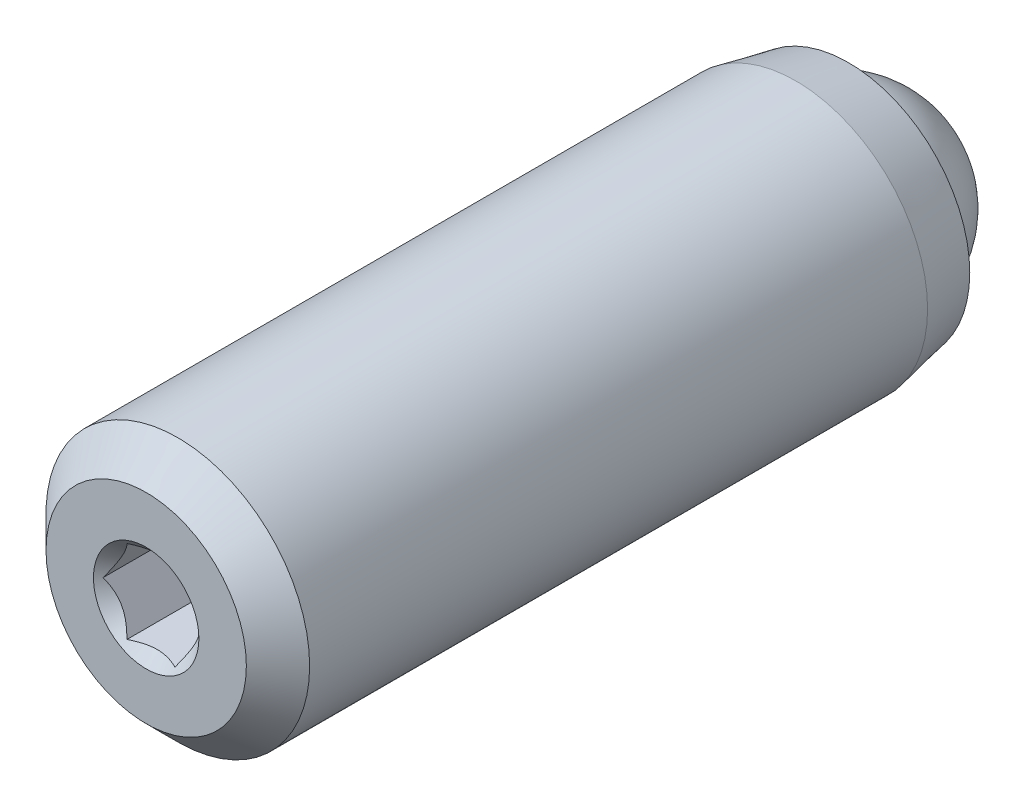
ISO-10303-21;
HEADER;
FILE_DESCRIPTION(('STEP AP214'),'2;1');
FILE_NAME('part.step','',(''),(''),'','','');
FILE_SCHEMA(('AUTOMOTIVE_DESIGN { 1 0 10303 214 1 1 1 1 }'));
ENDSEC;
DATA;
#1=APPLICATION_CONTEXT('core data for automotive mechanical design processes');
#2=APPLICATION_PROTOCOL_DEFINITION('international standard','automotive_design',2000,#1);
#3=PRODUCT_CONTEXT('',#1,'mechanical');
#4=PRODUCT('Part','Part','',(#3));
#5=PRODUCT_RELATED_PRODUCT_CATEGORY('part','',(#4));
#6=PRODUCT_DEFINITION_FORMATION('','',#4);
#7=PRODUCT_DEFINITION_CONTEXT('part definition',#1,'design');
#8=PRODUCT_DEFINITION('design','',#6,#7);
#9=PRODUCT_DEFINITION_SHAPE('','',#8);
#10=(LENGTH_UNIT() NAMED_UNIT(*) SI_UNIT(.MILLI.,.METRE.));
#11=(NAMED_UNIT(*) PLANE_ANGLE_UNIT() SI_UNIT($,.RADIAN.));
#12=(NAMED_UNIT(*) SI_UNIT($,.STERADIAN.) SOLID_ANGLE_UNIT());
#13=UNCERTAINTY_MEASURE_WITH_UNIT(LENGTH_MEASURE(1.E-05),#10,'distance_accuracy_value','');
#14=(GEOMETRIC_REPRESENTATION_CONTEXT(3) GLOBAL_UNCERTAINTY_ASSIGNED_CONTEXT((#13)) GLOBAL_UNIT_ASSIGNED_CONTEXT((#10,
#11,#12)) REPRESENTATION_CONTEXT('',''));
#15=CARTESIAN_POINT('',(0.,0.,0.));
#16=DIRECTION('',(0.,0.,1.));
#17=DIRECTION('',(1.,0.,0.));
#18=AXIS2_PLACEMENT_3D('',#15,#16,#17);
#19=CARTESIAN_POINT('',(9.74273900584421,-6.14099144723923,4.31418836824711));
#20=DIRECTION('',(0.,0.,-1.));
#21=DIRECTION('',(-1.,0.,0.));
#22=AXIS2_PLACEMENT_3D('',#19,#20,#21);
#23=PLANE('',#22);
#24=CARTESIAN_POINT('',(9.74273900584421,-6.14099144723923,4.31418836824711));
#25=DIRECTION('',(0.,0.,1.));
#26=DIRECTION('',(1.,0.,0.));
#27=AXIS2_PLACEMENT_3D('',#24,#25,#26);
#28=CIRCLE('',#27,1.27);
#29=CARTESIAN_POINT('',(11.0127390058442,-6.14099144723923,4.31418836824711));
#30=VERTEX_POINT('',#29);
#31=EDGE_CURVE('P0_E247',#30,#30,#28,.T.);
#32=ORIENTED_EDGE('',*,*,#31,.F.);
#33=EDGE_LOOP('',(#32));
#34=FACE_BOUND('',#33,.T.);
#35=CARTESIAN_POINT('',(9.74273900584421,-6.14099144723923,4.31418836824711));
#36=DIRECTION('',(0.,0.,1.));
#37=DIRECTION('',(1.,0.,0.));
#38=AXIS2_PLACEMENT_3D('',#35,#36,#37);
#39=CIRCLE('',#38,2.413);
#40=CARTESIAN_POINT('',(12.1557390058442,-6.14099144723923,4.31418836824711));
#41=VERTEX_POINT('',#40);
#42=EDGE_CURVE('P0_E162',#41,#41,#39,.T.);
#43=ORIENTED_EDGE('',*,*,#42,.T.);
#44=EDGE_LOOP('',(#43));
#45=FACE_BOUND('',#44,.T.);
#46=ADVANCED_FACE('P0_F17',(#34,#45),#23,.F.);
#47=CARTESIAN_POINT('',(9.74273900584421,-6.14099144723923,3.55218836824711));
#48=DIRECTION('',(0.,0.,-1.));
#49=DIRECTION('',(-1.,0.,0.));
#50=AXIS2_PLACEMENT_3D('',#47,#48,#49);
#51=CONICAL_SURFACE('',#50,3.175,0.785398163397448);
#52=ORIENTED_EDGE('',*,*,#42,.F.);
#53=EDGE_LOOP('',(#52));
#54=FACE_BOUND('',#53,.T.);
#55=CARTESIAN_POINT('',(9.74273900584421,-6.14099144723923,3.55218836824711));
#56=DIRECTION('',(0.,0.,1.));
#57=DIRECTION('',(1.,0.,0.));
#58=AXIS2_PLACEMENT_3D('',#55,#56,#57);
#59=CIRCLE('',#58,3.175);
#60=CARTESIAN_POINT('',(12.9177390058442,-6.14099144723923,3.55218836824711));
#61=VERTEX_POINT('',#60);
#62=EDGE_CURVE('P0_E160',#61,#61,#59,.T.);
#63=ORIENTED_EDGE('',*,*,#62,.T.);
#64=EDGE_LOOP('',(#63));
#65=FACE_BOUND('',#64,.T.);
#66=ADVANCED_FACE('P0_F311',(#54,#65),#51,.T.);
#67=CARTESIAN_POINT('',(9.74273900584421,-6.14099144723923,4.31418836824711));
#68=DIRECTION('',(0.,0.,1.));
#69=DIRECTION('',(1.,0.,0.));
#70=AXIS2_PLACEMENT_3D('',#67,#68,#69);
#71=CYLINDRICAL_SURFACE('',#70,3.175);
#72=ORIENTED_EDGE('',*,*,#62,.F.);
#73=EDGE_LOOP('',(#72));
#74=FACE_BOUND('',#73,.T.);
#75=CARTESIAN_POINT('',(9.74273900584421,-6.14099144723923,-11.3322116317529));
#76=DIRECTION('',(0.,0.,1.));
#77=DIRECTION('',(1.,0.,0.));
#78=AXIS2_PLACEMENT_3D('',#75,#76,#77);
#79=CIRCLE('',#78,3.175);
#80=CARTESIAN_POINT('',(12.9177390058442,-6.14099144723923,-11.3322116317529));
#81=VERTEX_POINT('',#80);
#82=EDGE_CURVE('P0_E157',#81,#81,#79,.T.);
#83=ORIENTED_EDGE('',*,*,#82,.T.);
#84=EDGE_LOOP('',(#83));
#85=FACE_BOUND('',#84,.T.);
#86=ADVANCED_FACE('P0_F316',(#74,#85),#71,.T.);
#87=CARTESIAN_POINT('',(9.74273900584421,-6.14099144723923,-12.6022116317529));
#88=DIRECTION('',(0.,0.,1.));
#89=DIRECTION('',(1.,0.,0.));
#90=AXIS2_PLACEMENT_3D('',#87,#88,#89);
#91=CONICAL_SURFACE('',#90,2.921,0.197395559849881);
#92=ORIENTED_EDGE('',*,*,#82,.F.);
#93=EDGE_LOOP('',(#92));
#94=FACE_BOUND('',#93,.T.);
#95=CARTESIAN_POINT('',(9.74273900584421,-6.14099144723923,-12.6022116317529));
#96=DIRECTION('',(0.,0.,1.));
#97=DIRECTION('',(1.,0.,0.));
#98=AXIS2_PLACEMENT_3D('',#95,#96,#97);
#99=CIRCLE('',#98,2.921);
#100=CARTESIAN_POINT('',(12.6637390058442,-6.14099144723923,-12.6022116317529));
#101=VERTEX_POINT('',#100);
#102=EDGE_CURVE('P0_E154',#101,#101,#99,.T.);
#103=ORIENTED_EDGE('',*,*,#102,.T.);
#104=EDGE_LOOP('',(#103));
#105=FACE_BOUND('',#104,.T.);
#106=ADVANCED_FACE('P0_F322',(#94,#105),#91,.T.);
#107=CARTESIAN_POINT('',(9.74273900584421,-3.21999144723923,-12.6022116317529));
#108=DIRECTION('',(0.,0.,1.));
#109=DIRECTION('',(1.,0.,0.));
#110=AXIS2_PLACEMENT_3D('',#107,#108,#109);
#111=PLANE('',#110);
#112=ORIENTED_EDGE('',*,*,#102,.F.);
#113=EDGE_LOOP('',(#112));
#114=FACE_BOUND('',#113,.T.);
#115=CARTESIAN_POINT('',(9.74273900584421,-6.14099144723923,-12.6022116317529));
#116=DIRECTION('',(0.,0.,1.));
#117=DIRECTION('',(1.,0.,0.));
#118=AXIS2_PLACEMENT_3D('',#115,#116,#117);
#119=CIRCLE('',#118,2.3876);
#120=CARTESIAN_POINT('',(12.1303390058442,-6.14099144723923,-12.6022116317529));
#121=VERTEX_POINT('',#120);
#122=EDGE_CURVE('P0_E151',#121,#121,#119,.T.);
#123=ORIENTED_EDGE('',*,*,#122,.T.);
#124=EDGE_LOOP('',(#123));
#125=FACE_BOUND('',#124,.T.);
#126=ADVANCED_FACE('P0_F329',(#114,#125),#111,.F.);
#127=CARTESIAN_POINT('',(9.74273900584421,-6.14099144723923,4.31418836824711));
#128=DIRECTION('',(0.,0.,1.));
#129=DIRECTION('',(1.,0.,0.));
#130=AXIS2_PLACEMENT_3D('',#127,#128,#129);
#131=CYLINDRICAL_SURFACE('',#130,2.3876);
#132=ORIENTED_EDGE('',*,*,#122,.F.);
#133=EDGE_LOOP('',(#132));
#134=FACE_BOUND('',#133,.T.);
#135=CARTESIAN_POINT('',(9.74273900584421,-6.14099144723923,-11.374565586352));
#136=DIRECTION('',(0.,0.,1.));
#137=DIRECTION('',(1.,0.,0.));
#138=AXIS2_PLACEMENT_3D('',#135,#136,#137);
#139=CIRCLE('',#138,2.3876);
#140=CARTESIAN_POINT('',(12.1303390058442,-6.14099144723923,-11.374565586352));
#141=VERTEX_POINT('',#140);
#142=EDGE_CURVE('P0_E148',#141,#141,#139,.T.);
#143=ORIENTED_EDGE('',*,*,#142,.T.);
#144=EDGE_LOOP('',(#143));
#145=FACE_BOUND('',#144,.T.);
#146=ADVANCED_FACE('P0_F333',(#134,#145),#131,.F.);
#147=CARTESIAN_POINT('',(9.74273900584421,-6.14099144723923,-8.98696558635194));
#148=DIRECTION('',(0.,0.,-1.));
#149=DIRECTION('',(-1.,0.,0.));
#150=AXIS2_PLACEMENT_3D('',#147,#148,#149);
#151=CONICAL_SURFACE('',#150,0.,0.785398163397443);
#152=ORIENTED_EDGE('',*,*,#142,.F.);
#153=EDGE_LOOP('',(#152));
#154=FACE_BOUND('',#153,.T.);
#155=CARTESIAN_POINT('',(9.74273900584421,-6.14099144723923,-8.98696558635194));
#156=VERTEX_POINT('',#155);
#157=VERTEX_LOOP('',#156);
#158=FACE_BOUND('',#157,.T.);
#159=ADVANCED_FACE('P0_F269',(#154,#158),#151,.F.);
#160=CARTESIAN_POINT('',(9.74273900584421,-6.14099144723923,3.04418836824709));
#161=DIRECTION('',(0.,0.,1.));
#162=DIRECTION('',(1.,0.,0.));
#163=AXIS2_PLACEMENT_3D('',#160,#161,#162);
#164=CONICAL_SURFACE('',#163,0.,0.785398163397443);
#165=ORIENTED_EDGE('',*,*,#31,.T.);
#166=EDGE_LOOP('',(#165));
#167=FACE_BOUND('',#166,.T.);
#168=CARTESIAN_POINT('',(10.8975550142773,-6.14079144723923,4.19900439399897));
#169=CARTESIAN_POINT('',(10.8777042137945,-6.17517404224641,4.17916683745209));
#170=CARTESIAN_POINT('',(10.8575214784036,-6.21013156537905,4.16049392726525));
#171=CARTESIAN_POINT('',(10.8163664011364,-6.28141425019532,4.12630364934952));
#172=CARTESIAN_POINT('',(10.795390141425,-6.31774619776821,4.11080531564982));
#173=CARTESIAN_POINT('',(10.7530923849422,-6.39100806104254,4.08425621376862));
#174=CARTESIAN_POINT('',(10.7317816719535,-6.42791929868464,4.07313868062328));
#175=CARTESIAN_POINT('',(10.6886912051269,-6.50255417655008,4.05600877240254));
#176=CARTESIAN_POINT('',(10.6669127684708,-6.54027553534786,4.04998360409303));
#177=CARTESIAN_POINT('',(10.6293803184842,-6.60528364565716,4.04454946159385));
#178=CARTESIAN_POINT('',(10.6136751365165,-6.6324858187674,4.04374584494309));
#179=CARTESIAN_POINT('',(10.5822951857071,-6.68683748790834,4.04509560604324));
#180=CARTESIAN_POINT('',(10.5666204243391,-6.7139869709941,4.04724963617355));
#181=CARTESIAN_POINT('',(10.5198199764436,-6.79504772456618,4.05800587875483));
#182=CARTESIAN_POINT('',(10.4889271969606,-6.84855558821765,4.07090346304171));
#183=CARTESIAN_POINT('',(10.4347071222639,-6.94246751238265,4.10202963722853));
#184=CARTESIAN_POINT('',(10.4111255631376,-6.98331197091106,4.11862670432819));
#185=CARTESIAN_POINT('',(10.3648860917779,-7.06340108462117,4.15601383131165));
#186=CARTESIAN_POINT('',(10.3422254554288,-7.10265045810967,4.17679024844376));
#187=CARTESIAN_POINT('',(10.31997380498,-7.14119144723923,4.19900439399897));
#188=B_SPLINE_CURVE_WITH_KNOTS('',3,(#168,#169,#170,#171,#172,#173,#174,#175,#176,#177,#178,
#179,#180,#181,#182,#183,#184,#185,#186,#187),.UNSPECIFIED.,.F.,.F.,(4,2,2,2,2,2,2,2,2,4),(0.,
0.133237676828557,0.267252229834487,0.399137076269296,0.530689603280762,0.62481486426384,
0.718960890149123,0.907306626112085,1.05710100361789,1.20641411519286),.UNSPECIFIED.);
#189=CARTESIAN_POINT('',(10.8974395442235,-6.14099144723923,4.19888890662636));
#190=VERTEX_POINT('',#189);
#191=CARTESIAN_POINT('',(10.3200892750338,-7.14099144723923,4.19888890662636));
#192=VERTEX_POINT('',#191);
#193=EDGE_CURVE('P0_E115',#190,#192,#188,.T.);
#194=ORIENTED_EDGE('',*,*,#193,.T.);
#195=CARTESIAN_POINT('',(8.51031050264178,-7.14099144723923,4.63128635372431));
#196=CARTESIAN_POINT('',(8.53998270076168,-7.14099144723923,4.6082484072783));
#197=CARTESIAN_POINT('',(8.56981104218133,-7.14099144723923,4.58541224539767));
#198=CARTESIAN_POINT('',(8.62984623000346,-7.14099144723923,4.54022912420729));
#199=CARTESIAN_POINT('',(8.66005316098693,-7.14099144723923,4.51788227739346));
#200=CARTESIAN_POINT('',(8.75178228815565,-7.14099144723923,4.45138534315059));
#201=CARTESIAN_POINT('',(8.81396452758707,-7.14099144723923,4.40813118503922));
#202=CARTESIAN_POINT('',(8.94491067802644,-7.14099144723923,4.32243125889816));
#203=CARTESIAN_POINT('',(9.0138370880217,-7.14099144723923,4.28023129139766));
#204=CARTESIAN_POINT('',(9.1552277602692,-7.14099144723923,4.20250206004232));
#205=CARTESIAN_POINT('',(9.2276789876563,-7.14099144723923,4.16695027043341));
#206=CARTESIAN_POINT('',(9.33568526371046,-7.14099144723923,4.12343424897431));
#207=CARTESIAN_POINT('',(9.36946583509232,-7.14099144723923,4.11109208210914));
#208=CARTESIAN_POINT('',(9.43791348520493,-7.14099144723923,4.08911273309591));
#209=CARTESIAN_POINT('',(9.47258061828307,-7.14099144723923,4.07947571721293));
#210=CARTESIAN_POINT('',(9.54196768302015,-7.14099144723923,4.06359667679777));
#211=CARTESIAN_POINT('',(9.57667273054637,-7.14099144723923,4.05729068819748));
#212=CARTESIAN_POINT('',(9.64655556321643,-7.14099144723923,4.04820649951787));
#213=CARTESIAN_POINT('',(9.68173339199748,-7.14099144723923,4.04542862737143));
#214=CARTESIAN_POINT('',(9.75049884638581,-7.14099144723923,4.04365606128879));
#215=CARTESIAN_POINT('',(9.78408198766287,-7.14099144723923,4.04448663999703));
#216=CARTESIAN_POINT('',(9.85098674621754,-7.14099144723923,4.04947664020862));
#217=CARTESIAN_POINT('',(9.88430842694802,-7.14099144723923,4.05363522712564));
#218=CARTESIAN_POINT('',(9.95103294348463,-7.14099144723923,4.06511190720631));
#219=CARTESIAN_POINT('',(9.9844257508201,-7.14099144723923,4.0724873543785));
#220=CARTESIAN_POINT('',(10.0504690645772,-7.14099144723923,4.08998167117632));
#221=CARTESIAN_POINT('',(10.0831196023826,-7.14099144723923,4.10010042457841));
#222=CARTESIAN_POINT('',(10.1825456951086,-7.14099144723923,4.13481096722407));
#223=CARTESIAN_POINT('',(10.2479876912246,-7.14099144723923,4.16320979591341));
#224=CARTESIAN_POINT('',(10.3758211422022,-7.14099144723923,4.2264268050646));
#225=CARTESIAN_POINT('',(10.4382009512613,-7.14099144723923,4.26126740155543));
#226=CARTESIAN_POINT('',(10.5574517880454,-7.14099144723923,4.33322605051449));
#227=CARTESIAN_POINT('',(10.6144428478589,-7.14099144723923,4.37014770752134));
#228=CARTESIAN_POINT('',(10.6984071950102,-7.14099144723923,4.42726054299713));
#229=CARTESIAN_POINT('',(10.7260346918042,-7.14099144723923,4.44650660504177));
#230=CARTESIAN_POINT('',(10.7809102254266,-7.14099144723923,4.48551716451218));
#231=CARTESIAN_POINT('',(10.8081583642475,-7.14099144723923,4.50528151830436));
#232=CARTESIAN_POINT('',(10.8352481880904,-7.14099144723923,4.52526105832419));
#233=B_SPLINE_CURVE_WITH_KNOTS('',3,(#195,#196,#197,#198,#199,#200,#201,#202,#203,#204,#205,
#206,#207,#208,#209,#210,#211,#212,#213,#214,#215,#216,#217,#218,#219,#220,#221,#222,#223,#224,
#225,#226,#227,#228,#229,#230,#231,#232),.UNSPECIFIED.,.F.,.F.,(4,2,2,2,2,2,2,2,2,2,2,2,2,2,2,2,
2,2,4),(0.,0.112694635133697,0.225414912901259,0.452565111221723,0.69484715433076,
0.936292788451031,1.04409719829335,1.15190823260368,1.25756594597726,1.36323347935069,
1.46384294190014,1.56442718186177,1.6668831555875,1.76933478931797,1.9827289310954,
2.19688011504817,2.40049475727374,2.50150167541717,2.60248089143825),.UNSPECIFIED.);
#234=CARTESIAN_POINT('',(9.16538873665459,-7.14099144723923,4.19888890662636));
#235=VERTEX_POINT('',#234);
#236=EDGE_CURVE('P0_E131',#192,#235,#233,.F.);
#237=ORIENTED_EDGE('',*,*,#236,.T.);
#238=CARTESIAN_POINT('',(9.16550420670843,-7.14119144723923,4.19900439399897));
#239=CARTESIAN_POINT('',(9.14565340622559,-7.10680885223205,4.17916683745209));
#240=CARTESIAN_POINT('',(9.12547067083476,-7.07185132909941,4.16049392726525));
#241=CARTESIAN_POINT('',(9.08431559356753,-7.00056864428314,4.12630364934951));
#242=CARTESIAN_POINT('',(9.06333933385613,-6.96423669671025,4.11080531564981));
#243=CARTESIAN_POINT('',(9.02104157737337,-6.89097483343592,4.08425621376862));
#244=CARTESIAN_POINT('',(8.99973086438458,-6.85406359579382,4.07313868062328));
#245=CARTESIAN_POINT('',(8.95664039755803,-6.77942871792838,4.05600877240254));
#246=CARTESIAN_POINT('',(8.93486196090194,-6.7417073591306,4.04998360409303));
#247=CARTESIAN_POINT('',(8.89732951091536,-6.6766992488213,4.04454946159385));
#248=CARTESIAN_POINT('',(8.88162432894762,-6.64949707571106,4.04374584494309));
#249=CARTESIAN_POINT('',(8.85024437813819,-6.59514540657012,4.04509560604324));
#250=CARTESIAN_POINT('',(8.83456961677027,-6.56799592348436,4.04724963617355));
#251=CARTESIAN_POINT('',(8.78776916887471,-6.48693516991228,4.05800587875482));
#252=CARTESIAN_POINT('',(8.75687638939177,-6.43342730626081,4.07090346304171));
#253=CARTESIAN_POINT('',(8.70265631469499,-6.33951538209581,4.10202963722853));
#254=CARTESIAN_POINT('',(8.67907475556871,-6.2986709235674,4.11862670432819));
#255=CARTESIAN_POINT('',(8.63283528420902,-6.21858180985729,4.15601383131165));
#256=CARTESIAN_POINT('',(8.61017464785992,-6.17933243636879,4.17679024844376));
#257=CARTESIAN_POINT('',(8.58792299741113,-6.14079144723923,4.19900439399897));
#258=B_SPLINE_CURVE_WITH_KNOTS('',3,(#238,#239,#240,#241,#242,#243,#244,#245,#246,#247,#248,
#249,#250,#251,#252,#253,#254,#255,#256,#257),.UNSPECIFIED.,.F.,.F.,(4,2,2,2,2,2,2,2,2,4),(0.,
0.133237676828558,0.267252229834487,0.399137076269296,0.530689603280762,0.624814864263839,
0.718960890149124,0.907306626112085,1.05710100361789,1.20641411519286),.UNSPECIFIED.);
#259=CARTESIAN_POINT('',(8.58803846746496,-6.14099144723923,4.19888890662636));
#260=VERTEX_POINT('',#259);
#261=EDGE_CURVE('P0_E249',#235,#260,#258,.T.);
#262=ORIENTED_EDGE('',*,*,#261,.T.);
#263=CARTESIAN_POINT('',(8.58792299741113,-6.14119144723923,4.19900439399897));
#264=CARTESIAN_POINT('',(8.60777379789396,-6.10680885223205,4.17916683745209));
#265=CARTESIAN_POINT('',(8.62795653328479,-6.07185132909941,4.16049392726525));
#266=CARTESIAN_POINT('',(8.66911161055202,-6.00056864428314,4.12630364934952));
#267=CARTESIAN_POINT('',(8.69008787026342,-5.96423669671025,4.11080531564982));
#268=CARTESIAN_POINT('',(8.73238562674618,-5.89097483343592,4.08425621376862));
#269=CARTESIAN_POINT('',(8.75369633973497,-5.85406359579382,4.07313868062328));
#270=CARTESIAN_POINT('',(8.79678680656152,-5.77942871792838,4.05600877240254));
#271=CARTESIAN_POINT('',(8.81856524321761,-5.7417073591306,4.04998360409303));
#272=CARTESIAN_POINT('',(8.8560976932042,-5.6766992488213,4.04454946159385));
#273=CARTESIAN_POINT('',(8.87180287517194,-5.64949707571106,4.04374584494309));
#274=CARTESIAN_POINT('',(8.90318282598136,-5.59514540657012,4.04509560604324));
#275=CARTESIAN_POINT('',(8.91885758734929,-5.56799592348436,4.04724963617355));
#276=CARTESIAN_POINT('',(8.96565803524484,-5.48693516991228,4.05800587875482));
#277=CARTESIAN_POINT('',(8.99655081472778,-5.43342730626081,4.07090346304171));
#278=CARTESIAN_POINT('',(9.05077088942456,-5.33951538209581,4.10202963722853));
#279=CARTESIAN_POINT('',(9.07435244855084,-5.2986709235674,4.11862670432819));
#280=CARTESIAN_POINT('',(9.12059191991053,-5.21858180985729,4.15601383131165));
#281=CARTESIAN_POINT('',(9.14325255625964,-5.17933243636879,4.17679024844376));
#282=CARTESIAN_POINT('',(9.16550420670843,-5.14079144723923,4.19900439399897));
#283=B_SPLINE_CURVE_WITH_KNOTS('',3,(#263,#264,#265,#266,#267,#268,#269,#270,#271,#272,#273,
#274,#275,#276,#277,#278,#279,#280,#281,#282),.UNSPECIFIED.,.F.,.F.,(4,2,2,2,2,2,2,2,2,4),(0.,
0.133237676828556,0.267252229834488,0.399137076269295,0.530689603280762,0.624814864263839,
0.718960890149123,0.907306626112083,1.05710100361789,1.20641411519286),.UNSPECIFIED.);
#284=CARTESIAN_POINT('',(9.16538873665459,-5.14099144723923,4.19888890662636));
#285=VERTEX_POINT('',#284);
#286=EDGE_CURVE('P0_E241',#260,#285,#283,.T.);
#287=ORIENTED_EDGE('',*,*,#286,.T.);
#288=CARTESIAN_POINT('',(8.51031050264178,-5.14099144723923,4.63128635372431));
#289=CARTESIAN_POINT('',(8.53998270076168,-5.14099144723923,4.6082484072783));
#290=CARTESIAN_POINT('',(8.56981104218133,-5.14099144723923,4.58541224539767));
#291=CARTESIAN_POINT('',(8.62984623000346,-5.14099144723923,4.54022912420729));
#292=CARTESIAN_POINT('',(8.66005316098693,-5.14099144723923,4.51788227739346));
#293=CARTESIAN_POINT('',(8.75178228815565,-5.14099144723923,4.45138534315059));
#294=CARTESIAN_POINT('',(8.81396452758707,-5.14099144723923,4.40813118503922));
#295=CARTESIAN_POINT('',(8.94491067802644,-5.14099144723923,4.32243125889816));
#296=CARTESIAN_POINT('',(9.01383708802169,-5.14099144723923,4.28023129139766));
#297=CARTESIAN_POINT('',(9.1552277602692,-5.14099144723923,4.20250206004232));
#298=CARTESIAN_POINT('',(9.2276789876563,-5.14099144723923,4.16695027043341));
#299=CARTESIAN_POINT('',(9.33568526371046,-5.14099144723923,4.12343424897431));
#300=CARTESIAN_POINT('',(9.36946583509232,-5.14099144723923,4.11109208210914));
#301=CARTESIAN_POINT('',(9.43791348520493,-5.14099144723923,4.08911273309591));
#302=CARTESIAN_POINT('',(9.47258061828307,-5.14099144723923,4.07947571721293));
#303=CARTESIAN_POINT('',(9.54196768302015,-5.14099144723923,4.06359667679777));
#304=CARTESIAN_POINT('',(9.57667273054637,-5.14099144723923,4.05729068819748));
#305=CARTESIAN_POINT('',(9.64655556321643,-5.14099144723923,4.04820649951787));
#306=CARTESIAN_POINT('',(9.68173339199748,-5.14099144723923,4.04542862737143));
#307=CARTESIAN_POINT('',(9.75049884638581,-5.14099144723923,4.04365606128879));
#308=CARTESIAN_POINT('',(9.78408198766287,-5.14099144723923,4.04448663999703));
#309=CARTESIAN_POINT('',(9.85098674621754,-5.14099144723923,4.04947664020862));
#310=CARTESIAN_POINT('',(9.88430842694802,-5.14099144723923,4.05363522712564));
#311=CARTESIAN_POINT('',(9.95103294348463,-5.14099144723923,4.06511190720631));
#312=CARTESIAN_POINT('',(9.9844257508201,-5.14099144723923,4.0724873543785));
#313=CARTESIAN_POINT('',(10.0504690645772,-5.14099144723923,4.08998167117632));
#314=CARTESIAN_POINT('',(10.0831196023826,-5.14099144723923,4.10010042457841));
#315=CARTESIAN_POINT('',(10.1825456951086,-5.14099144723923,4.13481096722407));
#316=CARTESIAN_POINT('',(10.2479876912246,-5.14099144723923,4.16320979591341));
#317=CARTESIAN_POINT('',(10.3758211422022,-5.14099144723923,4.2264268050646));
#318=CARTESIAN_POINT('',(10.4382009512613,-5.14099144723923,4.26126740155544));
#319=CARTESIAN_POINT('',(10.5574517880454,-5.14099144723923,4.3332260505145));
#320=CARTESIAN_POINT('',(10.6144428478589,-5.14099144723923,4.37014770752134));
#321=CARTESIAN_POINT('',(10.6984071950102,-5.14099144723923,4.42726054299713));
#322=CARTESIAN_POINT('',(10.7260346918042,-5.14099144723923,4.44650660504178));
#323=CARTESIAN_POINT('',(10.7809102254266,-5.14099144723923,4.48551716451218));
#324=CARTESIAN_POINT('',(10.8081583642475,-5.14099144723923,4.50528151830437));
#325=CARTESIAN_POINT('',(10.8352481880904,-5.14099144723923,4.52526105832419));
#326=B_SPLINE_CURVE_WITH_KNOTS('',3,(#288,#289,#290,#291,#292,#293,#294,#295,#296,#297,#298,
#299,#300,#301,#302,#303,#304,#305,#306,#307,#308,#309,#310,#311,#312,#313,#314,#315,#316,#317,
#318,#319,#320,#321,#322,#323,#324,#325),.UNSPECIFIED.,.F.,.F.,(4,2,2,2,2,2,2,2,2,2,2,2,2,2,2,2,
2,2,4),(0.,0.112694635133697,0.225414912901259,0.452565111221722,0.694847154330758,
0.936292788451031,1.04409719829335,1.15190823260368,1.25756594597726,1.36323347935069,
1.46384294190014,1.56442718186177,1.6668831555875,1.76933478931797,1.9827289310954,
2.19688011504817,2.40049475727374,2.50150167541718,2.60248089143825),.UNSPECIFIED.);
#327=CARTESIAN_POINT('',(10.3200892750338,-5.14099144723923,4.19888890662636));
#328=VERTEX_POINT('',#327);
#329=EDGE_CURVE('P0_E36',#285,#328,#326,.T.);
#330=ORIENTED_EDGE('',*,*,#329,.T.);
#331=CARTESIAN_POINT('',(10.31997380498,-5.14079144723923,4.19900439399897));
#332=CARTESIAN_POINT('',(10.3398246054628,-5.17517404224641,4.17916683745209));
#333=CARTESIAN_POINT('',(10.3600073408537,-5.21013156537905,4.16049392726525));
#334=CARTESIAN_POINT('',(10.4011624181209,-5.28141425019532,4.12630364934952));
#335=CARTESIAN_POINT('',(10.4221386778323,-5.31774619776821,4.11080531564982));
#336=CARTESIAN_POINT('',(10.4644364343151,-5.39100806104254,4.08425621376862));
#337=CARTESIAN_POINT('',(10.4857471473038,-5.42791929868464,4.07313868062328));
#338=CARTESIAN_POINT('',(10.5288376141304,-5.50255417655008,4.05600877240254));
#339=CARTESIAN_POINT('',(10.5506160507865,-5.54027553534786,4.04998360409303));
#340=CARTESIAN_POINT('',(10.5881485007731,-5.60528364565716,4.04454946159385));
#341=CARTESIAN_POINT('',(10.6038536827408,-5.6324858187674,4.04374584494309));
#342=CARTESIAN_POINT('',(10.6352336335502,-5.68683748790833,4.04509560604324));
#343=CARTESIAN_POINT('',(10.6509083949182,-5.7139869709941,4.04724963617355));
#344=CARTESIAN_POINT('',(10.6977088428137,-5.79504772456618,4.05800587875482));
#345=CARTESIAN_POINT('',(10.7286016222967,-5.84855558821765,4.07090346304171));
#346=CARTESIAN_POINT('',(10.7828216969934,-5.94246751238265,4.10202963722853));
#347=CARTESIAN_POINT('',(10.8064032561197,-5.98331197091106,4.11862670432819));
#348=CARTESIAN_POINT('',(10.8526427274794,-6.06340108462117,4.15601383131165));
#349=CARTESIAN_POINT('',(10.8753033638285,-6.10265045810967,4.17679024844376));
#350=CARTESIAN_POINT('',(10.8975550142773,-6.14119144723923,4.19900439399897));
#351=B_SPLINE_CURVE_WITH_KNOTS('',3,(#331,#332,#333,#334,#335,#336,#337,#338,#339,#340,#341,
#342,#343,#344,#345,#346,#347,#348,#349,#350),.UNSPECIFIED.,.F.,.F.,(4,2,2,2,2,2,2,2,2,4),(0.,
0.133237676828558,0.267252229834489,0.399137076269297,0.530689603280763,0.624814864263838,
0.718960890149123,0.907306626112084,1.05710100361789,1.20641411519286),.UNSPECIFIED.);
#352=EDGE_CURVE('P0_E11',#328,#190,#351,.T.);
#353=ORIENTED_EDGE('',*,*,#352,.T.);
#354=EDGE_LOOP('',(#194,#237,#262,#287,#330,#353));
#355=FACE_BOUND('',#354,.T.);
#356=ADVANCED_FACE('P0_F114',(#167,#355),#164,.F.);
#357=CARTESIAN_POINT('',(9.74273900584421,-6.14099144723923,0.351788368247108));
#358=DIRECTION('',(0.,0.,1.));
#359=DIRECTION('',(1.,0.,0.));
#360=AXIS2_PLACEMENT_3D('',#357,#358,#359);
#361=CONICAL_SURFACE('',#360,1.0414,1.02974425867665);
#362=CARTESIAN_POINT('',(9.74273900584421,-6.14099144723923,-0.273947880408193));
#363=VERTEX_POINT('',#362);
#364=VERTEX_LOOP('',#363);
#365=FACE_BOUND('',#364,.T.);
#366=CARTESIAN_POINT('',(9.74273900584421,-6.14099144723923,0.351788368247108));
#367=DIRECTION('',(0.,0.,1.));
#368=DIRECTION('',(1.,0.,0.));
#369=AXIS2_PLACEMENT_3D('',#366,#367,#368);
#370=CIRCLE('',#369,1.0414);
#371=CARTESIAN_POINT('',(10.7841390058442,-6.14099144723923,0.351788368247108));
#372=VERTEX_POINT('',#371);
#373=EDGE_CURVE('P0_E175',#372,#372,#370,.T.);
#374=ORIENTED_EDGE('',*,*,#373,.T.);
#375=EDGE_LOOP('',(#374));
#376=FACE_BOUND('',#375,.T.);
#377=ADVANCED_FACE('P0_F268',(#365,#376),#361,.F.);
#378=CARTESIAN_POINT('',(9.74273900584421,-6.14099144723923,1.26618836824711));
#379=DIRECTION('',(0.,0.,1.));
#380=DIRECTION('',(1.,0.,0.));
#381=AXIS2_PLACEMENT_3D('',#378,#379,#380);
#382=CYLINDRICAL_SURFACE('',#381,1.0414);
#383=ORIENTED_EDGE('',*,*,#373,.F.);
#384=EDGE_LOOP('',(#383));
#385=FACE_BOUND('',#384,.T.);
#386=CARTESIAN_POINT('',(9.74273900584421,-6.14099144723923,1.26618836824711));
#387=DIRECTION('',(0.,0.,1.));
#388=DIRECTION('',(1.,0.,0.));
#389=AXIS2_PLACEMENT_3D('',#386,#387,#388);
#390=CIRCLE('',#389,1.0414);
#391=CARTESIAN_POINT('',(10.7541208336353,-5.89275615882527,1.26618836824711));
#392=VERTEX_POINT('',#391);
#393=CARTESIAN_POINT('',(10.463407985622,-5.38922673565319,1.26618836824711));
#394=VERTEX_POINT('',#393);
#395=EDGE_CURVE('P0_E169',#392,#394,#390,.T.);
#396=ORIENTED_EDGE('',*,*,#395,.T.);
#397=CARTESIAN_POINT('',(10.0334518538575,-5.14099144723923,1.26618836824711));
#398=VERTEX_POINT('',#397);
#399=EDGE_CURVE('P0_E30',#394,#398,#390,.T.);
#400=ORIENTED_EDGE('',*,*,#399,.T.);
#401=CARTESIAN_POINT('',(9.45202615783092,-5.14099144723923,1.26618836824711));
#402=VERTEX_POINT('',#401);
#403=EDGE_CURVE('P0_E176',#398,#402,#390,.T.);
#404=ORIENTED_EDGE('',*,*,#403,.T.);
#405=CARTESIAN_POINT('',(9.02207002606642,-5.3892267356532,1.26618836824711));
#406=VERTEX_POINT('',#405);
#407=EDGE_CURVE('P0_E198',#402,#406,#390,.T.);
#408=ORIENTED_EDGE('',*,*,#407,.T.);
#409=CARTESIAN_POINT('',(8.73135717805313,-5.89275615882527,1.26618836824711));
#410=VERTEX_POINT('',#409);
#411=EDGE_CURVE('P0_E182',#406,#410,#390,.T.);
#412=ORIENTED_EDGE('',*,*,#411,.T.);
#413=CARTESIAN_POINT('',(8.73135717805313,-6.3892267356532,1.26618836824711));
#414=VERTEX_POINT('',#413);
#415=EDGE_CURVE('P0_E195',#410,#414,#390,.T.);
#416=ORIENTED_EDGE('',*,*,#415,.T.);
#417=CARTESIAN_POINT('',(9.02207002606642,-6.89275615882527,1.26618836824711));
#418=VERTEX_POINT('',#417);
#419=EDGE_CURVE('P0_E185',#414,#418,#390,.T.);
#420=ORIENTED_EDGE('',*,*,#419,.T.);
#421=CARTESIAN_POINT('',(9.45202615783092,-7.14099144723923,1.26618836824711));
#422=VERTEX_POINT('',#421);
#423=EDGE_CURVE('P0_E173',#418,#422,#390,.T.);
#424=ORIENTED_EDGE('',*,*,#423,.T.);
#425=CARTESIAN_POINT('',(10.0334518538575,-7.14099144723923,1.26618836824711));
#426=VERTEX_POINT('',#425);
#427=EDGE_CURVE('P0_E183',#422,#426,#390,.T.);
#428=ORIENTED_EDGE('',*,*,#427,.T.);
#429=CARTESIAN_POINT('',(10.463407985622,-6.89275615882526,1.26618836824711));
#430=VERTEX_POINT('',#429);
#431=EDGE_CURVE('P0_E167',#426,#430,#390,.T.);
#432=ORIENTED_EDGE('',*,*,#431,.T.);
#433=CARTESIAN_POINT('',(10.7541208336353,-6.3892267356532,1.26618836824711));
#434=VERTEX_POINT('',#433);
#435=EDGE_CURVE('P0_E44',#430,#434,#390,.T.);
#436=ORIENTED_EDGE('',*,*,#435,.T.);
#437=EDGE_CURVE('P0_E164',#434,#392,#390,.T.);
#438=ORIENTED_EDGE('',*,*,#437,.T.);
#439=EDGE_LOOP('',(#396,#400,#404,#408,#412,#416,#420,#424,#428,#432,#436,#438));
#440=FACE_BOUND('',#439,.T.);
#441=ADVANCED_FACE('P0_F194',(#385,#440),#382,.F.);
#442=CARTESIAN_POINT('',(10.7841390058442,-6.14099144723923,1.26618836824711));
#443=DIRECTION('',(0.,0.,1.));
#444=DIRECTION('',(1.,0.,0.));
#445=AXIS2_PLACEMENT_3D('',#442,#443,#444);
#446=PLANE('',#445);
#447=ORIENTED_EDGE('',*,*,#435,.F.);
#448=DIRECTION('',(0.5,0.866025403784439,0.));
#449=VECTOR('',#448,1.);
#450=CARTESIAN_POINT('',(10.3200892750338,-7.14099144723923,1.26618836824711));
#451=LINE('',#450,#449);
#452=EDGE_CURVE('P0_E400',#430,#434,#451,.T.);
#453=ORIENTED_EDGE('',*,*,#452,.T.);
#454=EDGE_LOOP('',(#447,#453));
#455=FACE_BOUND('',#454,.T.);
#456=ADVANCED_FACE('P0_F356',(#455),#446,.F.);
#457=DIRECTION('',(1.,0.,0.));
#458=VECTOR('',#457,1.);
#459=CARTESIAN_POINT('',(9.16538873665459,-7.14099144723923,1.26618836824711));
#460=LINE('',#459,#458);
#461=EDGE_CURVE('P0_E143',#422,#426,#460,.T.);
#462=ORIENTED_EDGE('',*,*,#461,.T.);
#463=ORIENTED_EDGE('',*,*,#427,.F.);
#464=EDGE_LOOP('',(#462,#463));
#465=FACE_BOUND('',#464,.T.);
#466=ADVANCED_FACE('P0_F365',(#465),#446,.F.);
#467=CARTESIAN_POINT('',(9.74273900584421,-6.14099144723923,1.26618836824711));
#468=DIRECTION('',(0.,0.,1.));
#469=DIRECTION('',(1.,0.,0.));
#470=AXIS2_PLACEMENT_3D('',#467,#468,#469);
#471=PLANE('',#470);
#472=ORIENTED_EDGE('',*,*,#431,.F.);
#473=CARTESIAN_POINT('',(10.3200892750338,-7.14099144723923,1.26618836824711));
#474=VERTEX_POINT('',#473);
#475=EDGE_CURVE('P0_E145',#426,#474,#460,.T.);
#476=ORIENTED_EDGE('',*,*,#475,.T.);
#477=EDGE_CURVE('P0_E401',#474,#430,#451,.T.);
#478=ORIENTED_EDGE('',*,*,#477,.T.);
#479=EDGE_LOOP('',(#472,#476,#478));
#480=FACE_BOUND('',#479,.T.);
#481=ADVANCED_FACE('P0_F360',(#480),#471,.T.);
#482=DIRECTION('',(0.5,-0.866025403784439,0.));
#483=VECTOR('',#482,1.);
#484=CARTESIAN_POINT('',(8.58803846746496,-6.14099144723923,1.26618836824711));
#485=LINE('',#484,#483);
#486=EDGE_CURVE('P0_E227',#414,#418,#485,.T.);
#487=ORIENTED_EDGE('',*,*,#486,.T.);
#488=ORIENTED_EDGE('',*,*,#419,.F.);
#489=EDGE_LOOP('',(#487,#488));
#490=FACE_BOUND('',#489,.T.);
#491=ADVANCED_FACE('P0_F364',(#490),#446,.F.);
#492=ORIENTED_EDGE('',*,*,#423,.F.);
#493=CARTESIAN_POINT('',(9.16538873665459,-7.14099144723923,1.26618836824711));
#494=VERTEX_POINT('',#493);
#495=EDGE_CURVE('P0_E225',#418,#494,#485,.T.);
#496=ORIENTED_EDGE('',*,*,#495,.T.);
#497=EDGE_CURVE('P0_E138',#494,#422,#460,.T.);
#498=ORIENTED_EDGE('',*,*,#497,.T.);
#499=EDGE_LOOP('',(#492,#496,#498));
#500=FACE_BOUND('',#499,.T.);
#501=ADVANCED_FACE('P0_F366',(#500),#471,.T.);
#502=DIRECTION('',(-0.5,-0.866025403784439,0.));
#503=VECTOR('',#502,1.);
#504=CARTESIAN_POINT('',(9.16538873665459,-5.14099144723923,1.26618836824711));
#505=LINE('',#504,#503);
#506=EDGE_CURVE('P0_E213',#406,#410,#505,.T.);
#507=ORIENTED_EDGE('',*,*,#506,.T.);
#508=ORIENTED_EDGE('',*,*,#411,.F.);
#509=EDGE_LOOP('',(#507,#508));
#510=FACE_BOUND('',#509,.T.);
#511=ADVANCED_FACE('P0_F372',(#510),#446,.F.);
#512=ORIENTED_EDGE('',*,*,#415,.F.);
#513=CARTESIAN_POINT('',(8.58803846746496,-6.14099144723923,1.26618836824711));
#514=VERTEX_POINT('',#513);
#515=EDGE_CURVE('P0_E205',#410,#514,#505,.T.);
#516=ORIENTED_EDGE('',*,*,#515,.T.);
#517=EDGE_CURVE('P0_E208',#514,#414,#485,.T.);
#518=ORIENTED_EDGE('',*,*,#517,.T.);
#519=EDGE_LOOP('',(#512,#516,#518));
#520=FACE_BOUND('',#519,.T.);
#521=ADVANCED_FACE('P0_F204',(#520),#471,.T.);
#522=DIRECTION('',(-1.,0.,0.));
#523=VECTOR('',#522,1.);
#524=CARTESIAN_POINT('',(10.3200892750338,-5.14099144723923,1.26618836824711));
#525=LINE('',#524,#523);
#526=EDGE_CURVE('P0_E221',#398,#402,#525,.T.);
#527=ORIENTED_EDGE('',*,*,#526,.T.);
#528=ORIENTED_EDGE('',*,*,#403,.F.);
#529=EDGE_LOOP('',(#527,#528));
#530=FACE_BOUND('',#529,.T.);
#531=ADVANCED_FACE('P0_F355',(#530),#446,.F.);
#532=ORIENTED_EDGE('',*,*,#407,.F.);
#533=CARTESIAN_POINT('',(9.16538873665459,-5.14099144723923,1.26618836824711));
#534=VERTEX_POINT('',#533);
#535=EDGE_CURVE('P0_E223',#402,#534,#525,.T.);
#536=ORIENTED_EDGE('',*,*,#535,.T.);
#537=EDGE_CURVE('P0_E219',#534,#406,#505,.T.);
#538=ORIENTED_EDGE('',*,*,#537,.T.);
#539=EDGE_LOOP('',(#532,#536,#538));
#540=FACE_BOUND('',#539,.T.);
#541=ADVANCED_FACE('P0_F350',(#540),#471,.T.);
#542=ORIENTED_EDGE('',*,*,#437,.F.);
#543=CARTESIAN_POINT('',(10.8974395442235,-6.14099144723923,1.26618836824711));
#544=VERTEX_POINT('',#543);
#545=EDGE_CURVE('P0_E180',#434,#544,#451,.T.);
#546=ORIENTED_EDGE('',*,*,#545,.T.);
#547=DIRECTION('',(-0.5,0.866025403784438,0.));
#548=VECTOR('',#547,1.);
#549=CARTESIAN_POINT('',(10.8974395442235,-6.14099144723923,1.26618836824711));
#550=LINE('',#549,#548);
#551=EDGE_CURVE('P0_E136',#544,#392,#550,.T.);
#552=ORIENTED_EDGE('',*,*,#551,.T.);
#553=EDGE_LOOP('',(#542,#546,#552));
#554=FACE_BOUND('',#553,.T.);
#555=ADVANCED_FACE('P0_F299',(#554),#471,.T.);
#556=EDGE_CURVE('P0_E404',#392,#394,#550,.T.);
#557=ORIENTED_EDGE('',*,*,#556,.T.);
#558=ORIENTED_EDGE('',*,*,#395,.F.);
#559=EDGE_LOOP('',(#557,#558));
#560=FACE_BOUND('',#559,.T.);
#561=ADVANCED_FACE('P0_F348',(#560),#446,.F.);
#562=ORIENTED_EDGE('',*,*,#399,.F.);
#563=CARTESIAN_POINT('',(10.3200892750338,-5.14099144723923,1.26618836824711));
#564=VERTEX_POINT('',#563);
#565=EDGE_CURVE('P0_E403',#394,#564,#550,.T.);
#566=ORIENTED_EDGE('',*,*,#565,.T.);
#567=EDGE_CURVE('P0_E217',#564,#398,#525,.T.);
#568=ORIENTED_EDGE('',*,*,#567,.T.);
#569=EDGE_LOOP('',(#562,#566,#568));
#570=FACE_BOUND('',#569,.T.);
#571=ADVANCED_FACE('P0_F344',(#570),#471,.T.);
#572=CARTESIAN_POINT('',(10.8974395442235,-6.14099144723923,1.26618836824711));
#573=DIRECTION('',(0.866025403784438,0.5,0.));
#574=DIRECTION('',(-0.5,0.866025403784438,0.));
#575=AXIS2_PLACEMENT_3D('',#572,#573,#574);
#576=PLANE('',#575);
#577=ORIENTED_EDGE('',*,*,#352,.F.);
#578=DIRECTION('',(0.,0.,1.));
#579=VECTOR('',#578,1.);
#580=CARTESIAN_POINT('',(10.3200892750338,-5.14099144723923,1.26618836824711));
#581=LINE('',#580,#579);
#582=EDGE_CURVE('P0_E137',#564,#328,#581,.T.);
#583=ORIENTED_EDGE('',*,*,#582,.F.);
#584=ORIENTED_EDGE('',*,*,#565,.F.);
#585=ORIENTED_EDGE('',*,*,#556,.F.);
#586=ORIENTED_EDGE('',*,*,#551,.F.);
#587=DIRECTION('',(0.,0.,1.));
#588=VECTOR('',#587,1.);
#589=CARTESIAN_POINT('',(10.8974395442235,-6.14099144723923,1.26618836824711));
#590=LINE('',#589,#588);
#591=EDGE_CURVE('P0_E126',#544,#190,#590,.T.);
#592=ORIENTED_EDGE('',*,*,#591,.T.);
#593=EDGE_LOOP('',(#577,#583,#584,#585,#586,#592));
#594=FACE_BOUND('',#593,.T.);
#595=ADVANCED_FACE('P0_F133',(#594),#576,.F.);
#596=CARTESIAN_POINT('',(10.3200892750338,-5.14099144723923,1.26618836824711));
#597=DIRECTION('',(0.,1.,0.));
#598=DIRECTION('',(0.,0.,1.));
#599=AXIS2_PLACEMENT_3D('',#596,#597,#598);
#600=PLANE('',#599);
#601=ORIENTED_EDGE('',*,*,#329,.F.);
#602=DIRECTION('',(0.,0.,1.));
#603=VECTOR('',#602,1.);
#604=CARTESIAN_POINT('',(9.16538873665459,-5.14099144723923,1.26618836824711));
#605=LINE('',#604,#603);
#606=EDGE_CURVE('P0_E140',#534,#285,#605,.T.);
#607=ORIENTED_EDGE('',*,*,#606,.F.);
#608=ORIENTED_EDGE('',*,*,#535,.F.);
#609=ORIENTED_EDGE('',*,*,#526,.F.);
#610=ORIENTED_EDGE('',*,*,#567,.F.);
#611=ORIENTED_EDGE('',*,*,#582,.T.);
#612=EDGE_LOOP('',(#601,#607,#608,#609,#610,#611));
#613=FACE_BOUND('',#612,.T.);
#614=ADVANCED_FACE('P0_F244',(#613),#600,.F.);
#615=CARTESIAN_POINT('',(9.16538873665459,-5.14099144723923,1.26618836824711));
#616=DIRECTION('',(-0.866025403784439,0.5,0.));
#617=DIRECTION('',(-0.5,-0.866025403784439,0.));
#618=AXIS2_PLACEMENT_3D('',#615,#616,#617);
#619=PLANE('',#618);
#620=ORIENTED_EDGE('',*,*,#286,.F.);
#621=DIRECTION('',(0.,0.,1.));
#622=VECTOR('',#621,1.);
#623=CARTESIAN_POINT('',(8.58803846746496,-6.14099144723923,1.26618836824711));
#624=LINE('',#623,#622);
#625=EDGE_CURVE('P0_E216',#514,#260,#624,.T.);
#626=ORIENTED_EDGE('',*,*,#625,.F.);
#627=ORIENTED_EDGE('',*,*,#515,.F.);
#628=ORIENTED_EDGE('',*,*,#506,.F.);
#629=ORIENTED_EDGE('',*,*,#537,.F.);
#630=ORIENTED_EDGE('',*,*,#606,.T.);
#631=EDGE_LOOP('',(#620,#626,#627,#628,#629,#630));
#632=FACE_BOUND('',#631,.T.);
#633=ADVANCED_FACE('P0_F211',(#632),#619,.F.);
#634=CARTESIAN_POINT('',(8.58803846746496,-6.14099144723923,1.26618836824711));
#635=DIRECTION('',(-0.866025403784439,-0.5,0.));
#636=DIRECTION('',(0.5,-0.866025403784439,0.));
#637=AXIS2_PLACEMENT_3D('',#634,#635,#636);
#638=PLANE('',#637);
#639=ORIENTED_EDGE('',*,*,#261,.F.);
#640=DIRECTION('',(0.,0.,1.));
#641=VECTOR('',#640,1.);
#642=CARTESIAN_POINT('',(9.16538873665459,-7.14099144723923,1.26618836824711));
#643=LINE('',#642,#641);
#644=EDGE_CURVE('P0_E236',#494,#235,#643,.T.);
#645=ORIENTED_EDGE('',*,*,#644,.F.);
#646=ORIENTED_EDGE('',*,*,#495,.F.);
#647=ORIENTED_EDGE('',*,*,#486,.F.);
#648=ORIENTED_EDGE('',*,*,#517,.F.);
#649=ORIENTED_EDGE('',*,*,#625,.T.);
#650=EDGE_LOOP('',(#639,#645,#646,#647,#648,#649));
#651=FACE_BOUND('',#650,.T.);
#652=ADVANCED_FACE('P0_F297',(#651),#638,.F.);
#653=CARTESIAN_POINT('',(9.16538873665459,-7.14099144723923,1.26618836824711));
#654=DIRECTION('',(0.,-1.,0.));
#655=DIRECTION('',(1.,0.,0.));
#656=AXIS2_PLACEMENT_3D('',#653,#654,#655);
#657=PLANE('',#656);
#658=ORIENTED_EDGE('',*,*,#236,.F.);
#659=DIRECTION('',(0.,0.,1.));
#660=VECTOR('',#659,1.);
#661=CARTESIAN_POINT('',(10.3200892750338,-7.14099144723923,1.26618836824711));
#662=LINE('',#661,#660);
#663=EDGE_CURVE('P0_E130',#474,#192,#662,.T.);
#664=ORIENTED_EDGE('',*,*,#663,.F.);
#665=ORIENTED_EDGE('',*,*,#475,.F.);
#666=ORIENTED_EDGE('',*,*,#461,.F.);
#667=ORIENTED_EDGE('',*,*,#497,.F.);
#668=ORIENTED_EDGE('',*,*,#644,.T.);
#669=EDGE_LOOP('',(#658,#664,#665,#666,#667,#668));
#670=FACE_BOUND('',#669,.T.);
#671=ADVANCED_FACE('P0_F293',(#670),#657,.F.);
#672=CARTESIAN_POINT('',(10.3200892750338,-7.14099144723923,1.26618836824711));
#673=DIRECTION('',(0.866025403784439,-0.5,0.));
#674=DIRECTION('',(0.5,0.866025403784439,0.));
#675=AXIS2_PLACEMENT_3D('',#672,#673,#674);
#676=PLANE('',#675);
#677=ORIENTED_EDGE('',*,*,#193,.F.);
#678=ORIENTED_EDGE('',*,*,#591,.F.);
#679=ORIENTED_EDGE('',*,*,#545,.F.);
#680=ORIENTED_EDGE('',*,*,#452,.F.);
#681=ORIENTED_EDGE('',*,*,#477,.F.);
#682=ORIENTED_EDGE('',*,*,#663,.T.);
#683=EDGE_LOOP('',(#677,#678,#679,#680,#681,#682));
#684=FACE_BOUND('',#683,.T.);
#685=ADVANCED_FACE('P0_F124',(#684),#676,.F.);
#686=CLOSED_SHELL('',(#46,#66,#86,#106,#126,#146,#159,#356,#377,#441,#456,#466,#481,#491,#501,
#511,#521,#531,#541,#555,#561,#571,#595,#614,#633,#652,#671,#685));
#687=MANIFOLD_SOLID_BREP('P0_B1',#686);
#688=CARTESIAN_POINT('',(9.74273900584421,-6.14099144723923,-12.3545616317529));
#689=DIRECTION('',(0.,1.,0.));
#690=DIRECTION('',(1.,0.,0.));
#691=AXIS2_PLACEMENT_3D('',#688,#689,#690);
#692=SPHERICAL_SURFACE('',#691,2.38125);
#693=CARTESIAN_POINT('',(9.74273900584421,-6.14099144723923,-12.3545616317529));
#694=DIRECTION('',(0.,0.,-1.));
#695=DIRECTION('',(1.,0.,0.));
#696=AXIS2_PLACEMENT_3D('',#693,#694,#695);
#697=SPHERICAL_SURFACE('',#696,2.38125);
#698=CARTESIAN_POINT('',(9.74273900584421,-6.14099144723923,-12.3545616317529));
#699=DIRECTION('',(0.,0.,-1.));
#700=DIRECTION('',(1.,0.,0.));
#701=AXIS2_PLACEMENT_3D('',#698,#699,#700);
#702=CIRCLE('',#701,2.38125);
#703=CARTESIAN_POINT('',(12.1239890058442,-6.14099144723923,-12.3545616317529));
#704=VERTEX_POINT('',#703);
#705=EDGE_CURVE('P1_E9',#704,#704,#702,.T.);
#706=ORIENTED_EDGE('',*,*,#705,.T.);
#707=EDGE_LOOP('',(#706));
#708=FACE_BOUND('',#707,.T.);
#709=ADVANCED_FACE('P1_F14',(#708),#697,.T.);
#710=CARTESIAN_POINT('',(9.74273900584421,-6.14099144723923,-12.3545616317529));
#711=DIRECTION('',(0.,0.,-1.));
#712=DIRECTION('',(1.,0.,0.));
#713=AXIS2_PLACEMENT_3D('',#710,#711,#712);
#714=SPHERICAL_SURFACE('',#713,2.38125);
#715=ORIENTED_EDGE('',*,*,#705,.F.);
#716=EDGE_LOOP('',(#715));
#717=FACE_BOUND('',#716,.T.);
#718=ADVANCED_FACE('P1_F16',(#717),#714,.T.);
#719=CLOSED_SHELL('',(#709,#718));
#720=MANIFOLD_SOLID_BREP('P1_B1',#719);
#721=ADVANCED_BREP_SHAPE_REPRESENTATION('',(#18,#687,#720),#14);
#722=SHAPE_DEFINITION_REPRESENTATION(#9,#721);
ENDSEC;
END-ISO-10303-21;
